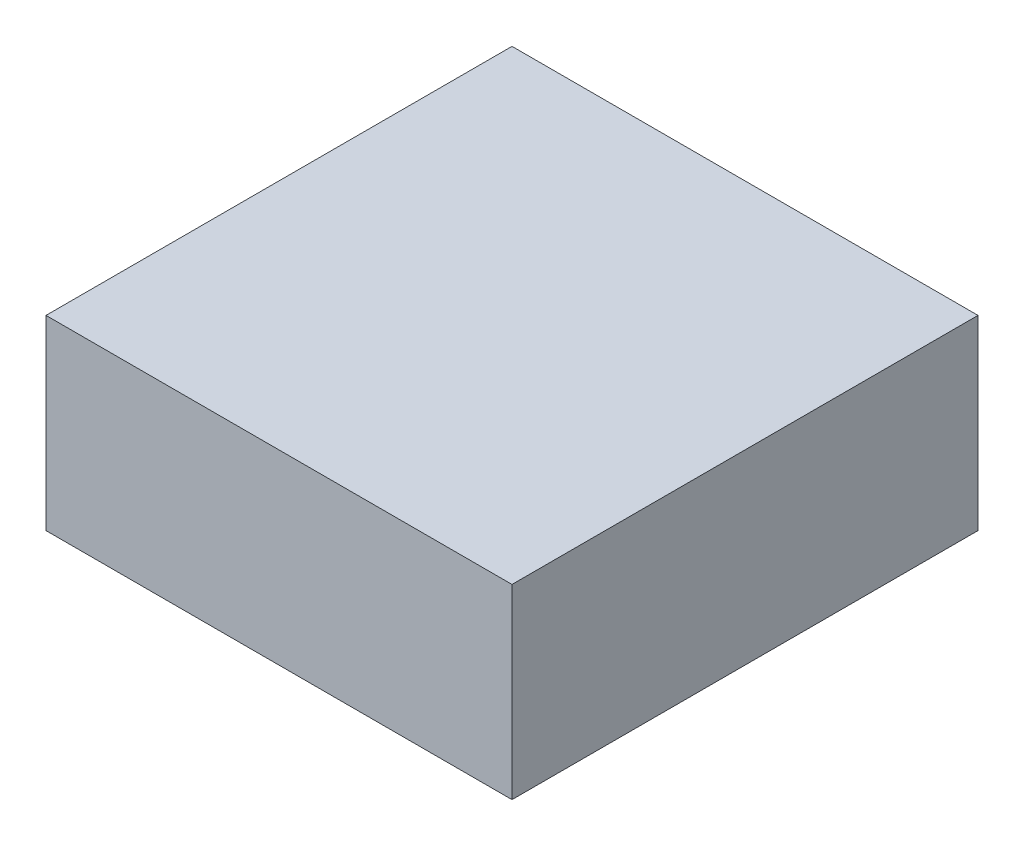
ISO-10303-21;
HEADER;
FILE_DESCRIPTION(('STEP AP214'),'2;1');
FILE_NAME('part.step','',(''),(''),'','','');
FILE_SCHEMA(('AUTOMOTIVE_DESIGN { 1 0 10303 214 1 1 1 1 }'));
ENDSEC;
DATA;
#1=APPLICATION_CONTEXT('core data for automotive mechanical design processes');
#2=APPLICATION_PROTOCOL_DEFINITION('international standard','automotive_design',2000,#1);
#3=PRODUCT_CONTEXT('',#1,'mechanical');
#4=PRODUCT('Part','Part','',(#3));
#5=PRODUCT_RELATED_PRODUCT_CATEGORY('part','',(#4));
#6=PRODUCT_DEFINITION_FORMATION('','',#4);
#7=PRODUCT_DEFINITION_CONTEXT('part definition',#1,'design');
#8=PRODUCT_DEFINITION('design','',#6,#7);
#9=PRODUCT_DEFINITION_SHAPE('','',#8);
#10=(LENGTH_UNIT() NAMED_UNIT(*) SI_UNIT(.MILLI.,.METRE.));
#11=(NAMED_UNIT(*) PLANE_ANGLE_UNIT() SI_UNIT($,.RADIAN.));
#12=(NAMED_UNIT(*) SI_UNIT($,.STERADIAN.) SOLID_ANGLE_UNIT());
#13=UNCERTAINTY_MEASURE_WITH_UNIT(LENGTH_MEASURE(1.E-05),#10,'distance_accuracy_value','');
#14=(GEOMETRIC_REPRESENTATION_CONTEXT(3) GLOBAL_UNCERTAINTY_ASSIGNED_CONTEXT((#13)) GLOBAL_UNIT_ASSIGNED_CONTEXT((#10,
#11,#12)) REPRESENTATION_CONTEXT('',''));
#15=CARTESIAN_POINT('',(0.,0.,0.));
#16=DIRECTION('',(0.,0.,1.));
#17=DIRECTION('',(1.,0.,0.));
#18=AXIS2_PLACEMENT_3D('',#15,#16,#17);
#19=CARTESIAN_POINT('',(0.,6.35,0.));
#20=DIRECTION('',(1.,0.,0.));
#21=DIRECTION('',(0.,0.,-1.));
#22=AXIS2_PLACEMENT_3D('',#19,#20,#21);
#23=PLANE('',#22);
#24=DIRECTION('',(0.,0.,1.));
#25=VECTOR('',#24,1.);
#26=CARTESIAN_POINT('',(0.,0.,0.));
#27=LINE('',#26,#25);
#28=CARTESIAN_POINT('',(0.,0.,-15.875));
#29=VERTEX_POINT('',#28);
#30=CARTESIAN_POINT('',(0.,0.,0.));
#31=VERTEX_POINT('',#30);
#32=EDGE_CURVE('E111',#29,#31,#27,.T.);
#33=ORIENTED_EDGE('',*,*,#32,.T.);
#34=DIRECTION('',(0.,-1.,0.));
#35=VECTOR('',#34,1.);
#36=CARTESIAN_POINT('',(0.,6.35,0.));
#37=LINE('',#36,#35);
#38=CARTESIAN_POINT('',(0.,6.35,0.));
#39=VERTEX_POINT('',#38);
#40=EDGE_CURVE('E11',#39,#31,#37,.T.);
#41=ORIENTED_EDGE('',*,*,#40,.F.);
#42=DIRECTION('',(0.,0.,1.));
#43=VECTOR('',#42,1.);
#44=CARTESIAN_POINT('',(0.,6.35,0.));
#45=LINE('',#44,#43);
#46=CARTESIAN_POINT('',(0.,6.35,-15.875));
#47=VERTEX_POINT('',#46);
#48=EDGE_CURVE('E95',#47,#39,#45,.T.);
#49=ORIENTED_EDGE('',*,*,#48,.F.);
#50=DIRECTION('',(0.,-1.,0.));
#51=VECTOR('',#50,1.);
#52=CARTESIAN_POINT('',(0.,6.35,-15.875));
#53=LINE('',#52,#51);
#54=EDGE_CURVE('E107',#47,#29,#53,.T.);
#55=ORIENTED_EDGE('',*,*,#54,.T.);
#56=EDGE_LOOP('',(#33,#41,#49,#55));
#57=FACE_BOUND('',#56,.T.);
#58=ADVANCED_FACE('F43',(#57),#23,.F.);
#59=CARTESIAN_POINT('',(0.,6.35,0.));
#60=DIRECTION('',(0.,0.,-1.));
#61=DIRECTION('',(-1.,0.,0.));
#62=AXIS2_PLACEMENT_3D('',#59,#60,#61);
#63=PLANE('',#62);
#64=DIRECTION('',(1.,0.,0.));
#65=VECTOR('',#64,1.);
#66=CARTESIAN_POINT('',(0.,0.,0.));
#67=LINE('',#66,#65);
#68=CARTESIAN_POINT('',(15.875,0.,0.));
#69=VERTEX_POINT('',#68);
#70=EDGE_CURVE('E100',#31,#69,#67,.T.);
#71=ORIENTED_EDGE('',*,*,#70,.T.);
#72=DIRECTION('',(0.,-1.,0.));
#73=VECTOR('',#72,1.);
#74=CARTESIAN_POINT('',(15.875,6.35,0.));
#75=LINE('',#74,#73);
#76=CARTESIAN_POINT('',(15.875,6.35,0.));
#77=VERTEX_POINT('',#76);
#78=EDGE_CURVE('E52',#77,#69,#75,.T.);
#79=ORIENTED_EDGE('',*,*,#78,.F.);
#80=DIRECTION('',(1.,0.,0.));
#81=VECTOR('',#80,1.);
#82=CARTESIAN_POINT('',(0.,6.35,0.));
#83=LINE('',#82,#81);
#84=EDGE_CURVE('E90',#39,#77,#83,.T.);
#85=ORIENTED_EDGE('',*,*,#84,.F.);
#86=ORIENTED_EDGE('',*,*,#40,.T.);
#87=EDGE_LOOP('',(#71,#79,#85,#86));
#88=FACE_BOUND('',#87,.T.);
#89=ADVANCED_FACE('F99',(#88),#63,.F.);
#90=CARTESIAN_POINT('',(15.875,6.35,0.));
#91=DIRECTION('',(-1.,0.,0.));
#92=DIRECTION('',(0.,0.,1.));
#93=AXIS2_PLACEMENT_3D('',#90,#91,#92);
#94=PLANE('',#93);
#95=DIRECTION('',(0.,0.,-1.));
#96=VECTOR('',#95,1.);
#97=CARTESIAN_POINT('',(15.875,0.,0.));
#98=LINE('',#97,#96);
#99=CARTESIAN_POINT('',(15.875,0.,-15.875));
#100=VERTEX_POINT('',#99);
#101=EDGE_CURVE('E77',#69,#100,#98,.T.);
#102=ORIENTED_EDGE('',*,*,#101,.T.);
#103=DIRECTION('',(0.,-1.,0.));
#104=VECTOR('',#103,1.);
#105=CARTESIAN_POINT('',(15.875,6.35,-15.875));
#106=LINE('',#105,#104);
#107=CARTESIAN_POINT('',(15.875,6.35,-15.875));
#108=VERTEX_POINT('',#107);
#109=EDGE_CURVE('E102',#108,#100,#106,.T.);
#110=ORIENTED_EDGE('',*,*,#109,.F.);
#111=DIRECTION('',(0.,0.,-1.));
#112=VECTOR('',#111,1.);
#113=CARTESIAN_POINT('',(15.875,6.35,0.));
#114=LINE('',#113,#112);
#115=EDGE_CURVE('E93',#77,#108,#114,.T.);
#116=ORIENTED_EDGE('',*,*,#115,.F.);
#117=ORIENTED_EDGE('',*,*,#78,.T.);
#118=EDGE_LOOP('',(#102,#110,#116,#117));
#119=FACE_BOUND('',#118,.T.);
#120=ADVANCED_FACE('F103',(#119),#94,.F.);
#121=CARTESIAN_POINT('',(0.,6.35,-15.875));
#122=DIRECTION('',(0.,0.,1.));
#123=DIRECTION('',(1.,0.,0.));
#124=AXIS2_PLACEMENT_3D('',#121,#122,#123);
#125=PLANE('',#124);
#126=DIRECTION('',(-1.,0.,0.));
#127=VECTOR('',#126,1.);
#128=CARTESIAN_POINT('',(0.,0.,-15.875));
#129=LINE('',#128,#127);
#130=EDGE_CURVE('E83',#100,#29,#129,.T.);
#131=ORIENTED_EDGE('',*,*,#130,.T.);
#132=ORIENTED_EDGE('',*,*,#54,.F.);
#133=DIRECTION('',(-1.,0.,0.));
#134=VECTOR('',#133,1.);
#135=CARTESIAN_POINT('',(0.,6.35,-15.875));
#136=LINE('',#135,#134);
#137=EDGE_CURVE('E60',#108,#47,#136,.T.);
#138=ORIENTED_EDGE('',*,*,#137,.F.);
#139=ORIENTED_EDGE('',*,*,#109,.T.);
#140=EDGE_LOOP('',(#131,#132,#138,#139));
#141=FACE_BOUND('',#140,.T.);
#142=ADVANCED_FACE('F124',(#141),#125,.F.);
#143=CARTESIAN_POINT('',(0.,6.35,0.));
#144=DIRECTION('',(0.,-1.,0.));
#145=DIRECTION('',(0.,0.,-1.));
#146=AXIS2_PLACEMENT_3D('',#143,#144,#145);
#147=PLANE('',#146);
#148=ORIENTED_EDGE('',*,*,#48,.T.);
#149=ORIENTED_EDGE('',*,*,#84,.T.);
#150=ORIENTED_EDGE('',*,*,#115,.T.);
#151=ORIENTED_EDGE('',*,*,#137,.T.);
#152=EDGE_LOOP('',(#148,#149,#150,#151));
#153=FACE_BOUND('',#152,.T.);
#154=ADVANCED_FACE('F91',(#153),#147,.F.);
#155=CARTESIAN_POINT('',(0.,0.,0.));
#156=DIRECTION('',(0.,-1.,0.));
#157=DIRECTION('',(0.,0.,-1.));
#158=AXIS2_PLACEMENT_3D('',#155,#156,#157);
#159=PLANE('',#158);
#160=ORIENTED_EDGE('',*,*,#32,.F.);
#161=ORIENTED_EDGE('',*,*,#130,.F.);
#162=ORIENTED_EDGE('',*,*,#101,.F.);
#163=ORIENTED_EDGE('',*,*,#70,.F.);
#164=EDGE_LOOP('',(#160,#161,#162,#163));
#165=FACE_BOUND('',#164,.T.);
#166=ADVANCED_FACE('F127',(#165),#159,.T.);
#167=CLOSED_SHELL('',(#58,#89,#120,#142,#154,#166));
#168=MANIFOLD_SOLID_BREP('B2',#167);
#169=ADVANCED_BREP_SHAPE_REPRESENTATION('',(#18,#168),#14);
#170=SHAPE_DEFINITION_REPRESENTATION(#9,#169);
ENDSEC;
END-ISO-10303-21;
